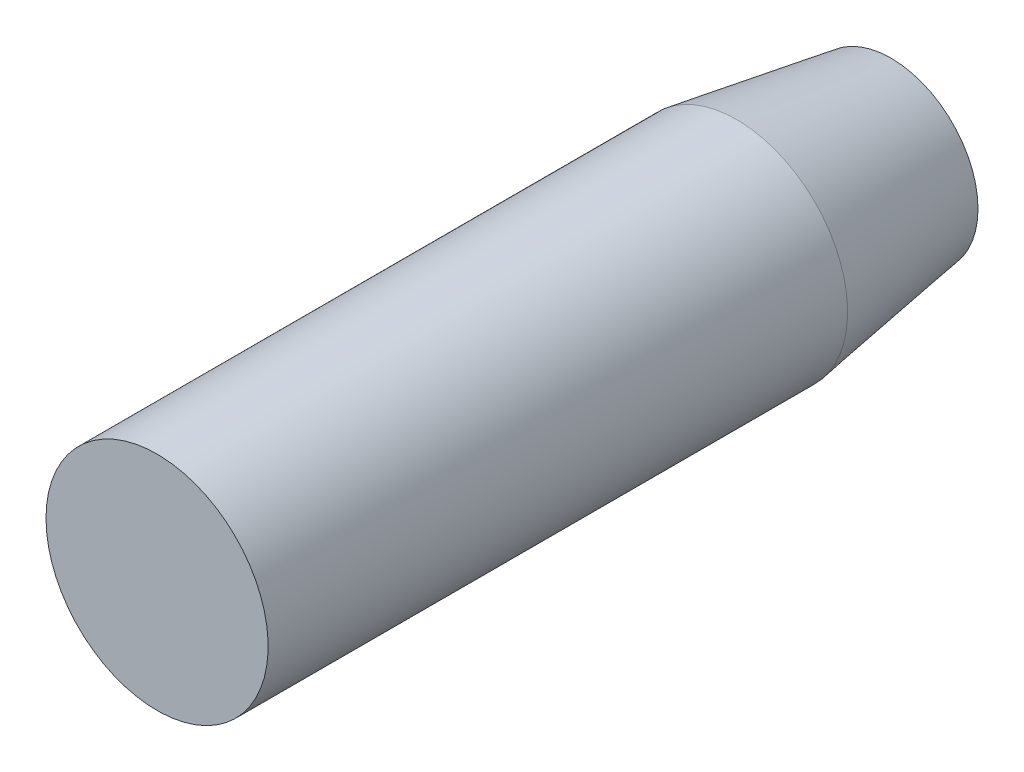
ISO-10303-21;
HEADER;
FILE_DESCRIPTION(('STEP AP214'),'2;1');
FILE_NAME('part.step','',(''),(''),'','','');
FILE_SCHEMA(('AUTOMOTIVE_DESIGN { 1 0 10303 214 1 1 1 1 }'));
ENDSEC;
DATA;
#1=APPLICATION_CONTEXT('core data for automotive mechanical design processes');
#2=APPLICATION_PROTOCOL_DEFINITION('international standard','automotive_design',2000,#1);
#3=PRODUCT_CONTEXT('',#1,'mechanical');
#4=PRODUCT('Part','Part','',(#3));
#5=PRODUCT_RELATED_PRODUCT_CATEGORY('part','',(#4));
#6=PRODUCT_DEFINITION_FORMATION('','',#4);
#7=PRODUCT_DEFINITION_CONTEXT('part definition',#1,'design');
#8=PRODUCT_DEFINITION('design','',#6,#7);
#9=PRODUCT_DEFINITION_SHAPE('','',#8);
#10=(LENGTH_UNIT() NAMED_UNIT(*) SI_UNIT(.MILLI.,.METRE.));
#11=(NAMED_UNIT(*) PLANE_ANGLE_UNIT() SI_UNIT($,.RADIAN.));
#12=(NAMED_UNIT(*) SI_UNIT($,.STERADIAN.) SOLID_ANGLE_UNIT());
#13=UNCERTAINTY_MEASURE_WITH_UNIT(LENGTH_MEASURE(1.E-05),#10,'distance_accuracy_value','');
#14=(GEOMETRIC_REPRESENTATION_CONTEXT(3) GLOBAL_UNCERTAINTY_ASSIGNED_CONTEXT((#13)) GLOBAL_UNIT_ASSIGNED_CONTEXT((#10,
#11,#12)) REPRESENTATION_CONTEXT('',''));
#15=CARTESIAN_POINT('',(0.,0.,0.));
#16=DIRECTION('',(0.,0.,1.));
#17=DIRECTION('',(1.,0.,0.));
#18=AXIS2_PLACEMENT_3D('',#15,#16,#17);
#19=CARTESIAN_POINT('',(0.,0.,-60.325));
#20=DIRECTION('',(0.,0.,1.));
#21=DIRECTION('',(-1.,0.,0.));
#22=AXIS2_PLACEMENT_3D('',#19,#20,#21);
#23=CYLINDRICAL_SURFACE('',#22,18.25625);
#24=CARTESIAN_POINT('',(0.,0.,-34.9250000000015));
#25=DIRECTION('',(0.,0.,1.));
#26=DIRECTION('',(1.,0.,0.));
#27=AXIS2_PLACEMENT_3D('',#24,#25,#26);
#28=CIRCLE('',#27,18.25625);
#29=CARTESIAN_POINT('',(-18.25625,0.,-34.9250000000015));
#30=VERTEX_POINT('',#29);
#31=EDGE_CURVE('E10',#30,#30,#28,.F.);
#32=CARTESIAN_POINT('',(0.,0.,60.325));
#33=DIRECTION('',(0.,0.,1.));
#34=DIRECTION('',(1.,0.,0.));
#35=AXIS2_PLACEMENT_3D('',#32,#33,#34);
#36=CIRCLE('',#35,18.25625);
#37=CARTESIAN_POINT('',(-18.25625,0.,60.325));
#38=VERTEX_POINT('',#37);
#39=EDGE_CURVE('E55',#38,#38,#36,.T.);
#40=CARTESIAN_POINT('',(-18.25625,0.,-34.9250000000015));
#41=CARTESIAN_POINT('',(-18.25625,0.,-33.9328125000015));
#42=CARTESIAN_POINT('',(-18.25625,0.,-32.9406250000014));
#43=CARTESIAN_POINT('',(-18.25625,0.,-30.9562500000014));
#44=CARTESIAN_POINT('',(-18.25625,0.,-29.9640625000014));
#45=CARTESIAN_POINT('',(-18.25625,0.,-27.9796875000014));
#46=CARTESIAN_POINT('',(-18.25625,0.,-26.9875000000014));
#47=CARTESIAN_POINT('',(-18.25625,0.,-25.0031250000013));
#48=CARTESIAN_POINT('',(-18.25625,0.,-24.0109375000013));
#49=CARTESIAN_POINT('',(-18.25625,0.,-22.0265625000013));
#50=CARTESIAN_POINT('',(-18.25625,0.,-21.0343750000013));
#51=CARTESIAN_POINT('',(-18.25625,0.,-19.0500000000012));
#52=CARTESIAN_POINT('',(-18.25625,0.,-18.0578125000012));
#53=CARTESIAN_POINT('',(-18.25625,0.,-16.0734375000012));
#54=CARTESIAN_POINT('',(-18.25625,0.,-15.0812500000012));
#55=CARTESIAN_POINT('',(-18.25625,0.,-13.0968750000011));
#56=CARTESIAN_POINT('',(-18.25625,0.,-12.1046875000011));
#57=CARTESIAN_POINT('',(-18.25625,0.,-10.1203125000011));
#58=CARTESIAN_POINT('',(-18.25625,0.,-9.12812500000108));
#59=CARTESIAN_POINT('',(-18.25625,0.,-7.14375000000105));
#60=CARTESIAN_POINT('',(-18.25625,0.,-6.15156250000103));
#61=CARTESIAN_POINT('',(-18.25625,0.,-4.167187500001));
#62=CARTESIAN_POINT('',(-18.25625,0.,-3.17500000000099));
#63=CARTESIAN_POINT('',(-18.25625,0.,-1.19062500000096));
#64=CARTESIAN_POINT('',(-18.25625,0.,-0.198437500000941));
#65=CARTESIAN_POINT('',(-18.25625,0.,1.78593749999909));
#66=CARTESIAN_POINT('',(-18.25625,0.,2.7781249999991));
#67=CARTESIAN_POINT('',(-18.25625,0.,4.76249999999913));
#68=CARTESIAN_POINT('',(-18.25625,0.,5.75468749999915));
#69=CARTESIAN_POINT('',(-18.25625,0.,7.73906249999918));
#70=CARTESIAN_POINT('',(-18.25625,0.,8.7312499999992));
#71=CARTESIAN_POINT('',(-18.25625,0.,10.7156249999992));
#72=CARTESIAN_POINT('',(-18.25625,0.,11.7078124999992));
#73=CARTESIAN_POINT('',(-18.25625,0.,13.6921874999993));
#74=CARTESIAN_POINT('',(-18.25625,0.,14.6843749999993));
#75=CARTESIAN_POINT('',(-18.25625,0.,16.6687499999993));
#76=CARTESIAN_POINT('',(-18.25625,0.,17.6609374999993));
#77=CARTESIAN_POINT('',(-18.25625,0.,19.6453124999994));
#78=CARTESIAN_POINT('',(-18.25625,0.,20.6374999999994));
#79=CARTESIAN_POINT('',(-18.25625,0.,22.6218749999994));
#80=CARTESIAN_POINT('',(-18.25625,0.,23.6140624999994));
#81=CARTESIAN_POINT('',(-18.25625,0.,25.5984374999995));
#82=CARTESIAN_POINT('',(-18.25625,0.,26.5906249999995));
#83=CARTESIAN_POINT('',(-18.25625,0.,28.5749999999995));
#84=CARTESIAN_POINT('',(-18.25625,0.,29.5671874999995));
#85=CARTESIAN_POINT('',(-18.25625,0.,31.5515624999995));
#86=CARTESIAN_POINT('',(-18.25625,0.,32.5437499999996));
#87=CARTESIAN_POINT('',(-18.25625,0.,34.5281249999996));
#88=CARTESIAN_POINT('',(-18.25625,0.,35.5203124999996));
#89=CARTESIAN_POINT('',(-18.25625,0.,37.5046874999996));
#90=CARTESIAN_POINT('',(-18.25625,0.,38.4968749999997));
#91=CARTESIAN_POINT('',(-18.25625,0.,40.4812499999997));
#92=CARTESIAN_POINT('',(-18.25625,0.,41.4734374999997));
#93=CARTESIAN_POINT('',(-18.25625,0.,43.4578124999997));
#94=CARTESIAN_POINT('',(-18.25625,0.,44.4499999999997));
#95=CARTESIAN_POINT('',(-18.25625,0.,46.4343749999998));
#96=CARTESIAN_POINT('',(-18.25625,0.,47.4265624999998));
#97=CARTESIAN_POINT('',(-18.25625,0.,49.4109374999998));
#98=CARTESIAN_POINT('',(-18.25625,0.,50.4031249999998));
#99=CARTESIAN_POINT('',(-18.25625,0.,52.3874999999999));
#100=CARTESIAN_POINT('',(-18.25625,0.,53.3796874999999));
#101=CARTESIAN_POINT('',(-18.25625,0.,55.3640624999999));
#102=CARTESIAN_POINT('',(-18.25625,0.,56.3562499999999));
#103=CARTESIAN_POINT('',(-18.25625,0.,58.340625));
#104=CARTESIAN_POINT('',(-18.25625,0.,59.3328125));
#105=CARTESIAN_POINT('',(-18.25625,0.,60.325));
#106=B_SPLINE_CURVE_WITH_KNOTS('',3,(#40,#41,#42,#43,#44,#45,#46,#47,#48,#49,#50,#51,#52,#53,
#54,#55,#56,#57,#58,#59,#60,#61,#62,#63,#64,#65,#66,#67,#68,#69,#70,#71,#72,#73,#74,#75,#76,#77,
#78,#79,#80,#81,#82,#83,#84,#85,#86,#87,#88,#89,#90,#91,#92,#93,#94,#95,#96,#97,#98,#99,#100,
#101,#102,#103,#104,#105),.UNSPECIFIED.,.F.,.F.,(4,2,2,2,2,2,2,2,2,2,2,2,2,2,2,2,2,2,2,2,2,2,2,
2,2,2,2,2,2,2,2,2,4),(0.,2.97656250000004,5.95312500000009,8.92968750000013,11.9062500000002,
14.8828125000002,17.8593750000003,20.8359375000003,23.8125000000004,26.7890625000004,
29.7656250000005,32.7421875000005,35.7187500000005,38.6953125000006,41.6718750000006,
44.6484375000007,47.6250000000007,50.6015625000008,53.5781250000008,56.5546875000009,
59.5312500000009,62.507812500001,65.484375000001,68.460937500001,71.4375000000011,
74.4140625000012,77.3906250000012,80.3671875000012,83.3437500000013,86.3203125000013,
89.2968750000014,92.2734375000014,95.2500000000015),.UNSPECIFIED.);
#107=EDGE_CURVE('BSEAM41',#30,#38,#106,.T.);
#108=ORIENTED_EDGE('',*,*,#31,.F.);
#109=ORIENTED_EDGE('',*,*,#39,.F.);
#110=ORIENTED_EDGE('',*,*,#107,.T.);
#111=ORIENTED_EDGE('',*,*,#107,.F.);
#112=EDGE_LOOP('',(#108,#110,#109,#111));
#113=FACE_BOUND('',#112,.T.);
#114=ADVANCED_FACE('F41',(#113),#23,.T.);
#115=CARTESIAN_POINT('',(0.,0.,-60.325));
#116=DIRECTION('',(0.,0.,-1.));
#117=DIRECTION('',(1.,0.,0.));
#118=AXIS2_PLACEMENT_3D('',#115,#116,#117);
#119=PLANE('',#118);
#120=CARTESIAN_POINT('',(0.,0.,-60.325));
#121=DIRECTION('',(0.,0.,1.));
#122=DIRECTION('',(1.,0.,0.));
#123=AXIS2_PLACEMENT_3D('',#120,#121,#122);
#124=CIRCLE('',#123,14.2875000000003);
#125=CARTESIAN_POINT('',(-14.2875000000003,0.,-60.325));
#126=VERTEX_POINT('',#125);
#127=EDGE_CURVE('E49',#126,#126,#124,.T.);
#128=ORIENTED_EDGE('',*,*,#127,.F.);
#129=EDGE_LOOP('',(#128));
#130=FACE_BOUND('',#129,.T.);
#131=ADVANCED_FACE('F65',(#130),#119,.T.);
#132=CARTESIAN_POINT('',(0.,0.,60.325));
#133=DIRECTION('',(0.,0.,-1.));
#134=DIRECTION('',(1.,0.,0.));
#135=AXIS2_PLACEMENT_3D('',#132,#133,#134);
#136=PLANE('',#135);
#137=ORIENTED_EDGE('',*,*,#39,.T.);
#138=EDGE_LOOP('',(#137));
#139=FACE_BOUND('',#138,.T.);
#140=ADVANCED_FACE('F62',(#139),#136,.F.);
#141=CARTESIAN_POINT('',(0.,0.,-60.325));
#142=DIRECTION('',(0.,0.,1.));
#143=DIRECTION('',(-1.,0.,0.));
#144=AXIS2_PLACEMENT_3D('',#141,#142,#143);
#145=CONICAL_SURFACE('',#144,14.2875000000003,0.154996741923938);
#146=CARTESIAN_POINT('',(-18.25625,0.,-34.9250000000015));
#147=CARTESIAN_POINT('',(-18.2149088541667,0.,-35.1895833333348));
#148=CARTESIAN_POINT('',(-18.1735677083333,0.,-35.4541666666681));
#149=CARTESIAN_POINT('',(-18.0908854166667,0.,-35.9833333333347));
#150=CARTESIAN_POINT('',(-18.0495442708333,0.,-36.2479166666681));
#151=CARTESIAN_POINT('',(-17.9668619791667,0.,-36.7770833333347));
#152=CARTESIAN_POINT('',(-17.9255208333334,0.,-37.041666666668));
#153=CARTESIAN_POINT('',(-17.8428385416667,0.,-37.5708333333346));
#154=CARTESIAN_POINT('',(-17.8014973958334,0.,-37.835416666668));
#155=CARTESIAN_POINT('',(-17.7188151041667,0.,-38.3645833333346));
#156=CARTESIAN_POINT('',(-17.6774739583334,0.,-38.6291666666679));
#157=CARTESIAN_POINT('',(-17.5947916666667,0.,-39.1583333333346));
#158=CARTESIAN_POINT('',(-17.5534505208334,0.,-39.4229166666679));
#159=CARTESIAN_POINT('',(-17.4707682291667,0.,-39.9520833333345));
#160=CARTESIAN_POINT('',(-17.4294270833334,0.,-40.2166666666678));
#161=CARTESIAN_POINT('',(-17.3467447916667,0.,-40.7458333333345));
#162=CARTESIAN_POINT('',(-17.3054036458334,0.,-41.0104166666678));
#163=CARTESIAN_POINT('',(-17.2227213541668,0.,-41.5395833333344));
#164=CARTESIAN_POINT('',(-17.1813802083334,0.,-41.8041666666677));
#165=CARTESIAN_POINT('',(-17.0986979166668,0.,-42.3333333333344));
#166=CARTESIAN_POINT('',(-17.0573567708334,0.,-42.5979166666677));
#167=CARTESIAN_POINT('',(-16.9746744791668,0.,-43.1270833333343));
#168=CARTESIAN_POINT('',(-16.9333333333334,0.,-43.3916666666676));
#169=CARTESIAN_POINT('',(-16.8506510416668,0.,-43.9208333333343));
#170=CARTESIAN_POINT('',(-16.8093098958335,0.,-44.1854166666676));
#171=CARTESIAN_POINT('',(-16.7266276041668,0.,-44.7145833333342));
#172=CARTESIAN_POINT('',(-16.6852864583335,0.,-44.9791666666676));
#173=CARTESIAN_POINT('',(-16.6026041666668,0.,-45.5083333333342));
#174=CARTESIAN_POINT('',(-16.5612630208335,0.,-45.7729166666675));
#175=CARTESIAN_POINT('',(-16.4785807291668,0.,-46.3020833333341));
#176=CARTESIAN_POINT('',(-16.4372395833335,0.,-46.5666666666675));
#177=CARTESIAN_POINT('',(-16.3545572916668,0.,-47.0958333333341));
#178=CARTESIAN_POINT('',(-16.3132161458335,0.,-47.3604166666674));
#179=CARTESIAN_POINT('',(-16.2305338541668,0.,-47.8895833333341));
#180=CARTESIAN_POINT('',(-16.1891927083335,0.,-48.1541666666674));
#181=CARTESIAN_POINT('',(-16.1065104166668,0.,-48.683333333334));
#182=CARTESIAN_POINT('',(-16.0651692708335,0.,-48.9479166666673));
#183=CARTESIAN_POINT('',(-15.9824869791668,0.,-49.477083333334));
#184=CARTESIAN_POINT('',(-15.9411458333335,0.,-49.7416666666673));
#185=CARTESIAN_POINT('',(-15.8584635416669,0.,-50.2708333333339));
#186=CARTESIAN_POINT('',(-15.8171223958335,0.,-50.5354166666672));
#187=CARTESIAN_POINT('',(-15.7344401041669,0.,-51.0645833333339));
#188=CARTESIAN_POINT('',(-15.6930989583335,0.,-51.3291666666672));
#189=CARTESIAN_POINT('',(-15.6104166666669,0.,-51.8583333333338));
#190=CARTESIAN_POINT('',(-15.5690755208336,0.,-52.1229166666671));
#191=CARTESIAN_POINT('',(-15.4863932291669,0.,-52.6520833333338));
#192=CARTESIAN_POINT('',(-15.4450520833336,0.,-52.9166666666671));
#193=CARTESIAN_POINT('',(-15.3623697916669,0.,-53.4458333333337));
#194=CARTESIAN_POINT('',(-15.3210286458336,0.,-53.7104166666671));
#195=CARTESIAN_POINT('',(-15.2383463541669,0.,-54.2395833333337));
#196=CARTESIAN_POINT('',(-15.1970052083336,0.,-54.504166666667));
#197=CARTESIAN_POINT('',(-15.1143229166669,0.,-55.0333333333336));
#198=CARTESIAN_POINT('',(-15.0729817708336,0.,-55.297916666667));
#199=CARTESIAN_POINT('',(-14.9902994791669,0.,-55.8270833333336));
#200=CARTESIAN_POINT('',(-14.9489583333336,0.,-56.0916666666669));
#201=CARTESIAN_POINT('',(-14.8662760416669,0.,-56.6208333333336));
#202=CARTESIAN_POINT('',(-14.8249348958336,0.,-56.8854166666669));
#203=CARTESIAN_POINT('',(-14.7422526041669,0.,-57.4145833333335));
#204=CARTESIAN_POINT('',(-14.7009114583336,0.,-57.6791666666668));
#205=CARTESIAN_POINT('',(-14.618229166667,0.,-58.2083333333335));
#206=CARTESIAN_POINT('',(-14.5768880208336,0.,-58.4729166666668));
#207=CARTESIAN_POINT('',(-14.494205729167,0.,-59.0020833333334));
#208=CARTESIAN_POINT('',(-14.4528645833336,0.,-59.2666666666667));
#209=CARTESIAN_POINT('',(-14.370182291667,0.,-59.7958333333334));
#210=CARTESIAN_POINT('',(-14.3288411458337,0.,-60.0604166666667));
#211=CARTESIAN_POINT('',(-14.2875000000003,0.,-60.325));
#212=B_SPLINE_CURVE_WITH_KNOTS('',3,(#146,#147,#148,#149,#150,#151,#152,#153,#154,#155,#156,
#157,#158,#159,#160,#161,#162,#163,#164,#165,#166,#167,#168,#169,#170,#171,#172,#173,#174,#175,
#176,#177,#178,#179,#180,#181,#182,#183,#184,#185,#186,#187,#188,#189,#190,#191,#192,#193,#194,
#195,#196,#197,#198,#199,#200,#201,#202,#203,#204,#205,#206,#207,#208,#209,#210,#211),
.UNSPECIFIED.,.F.,.F.,(4,2,2,2,2,2,2,2,2,2,2,2,2,2,2,2,2,2,2,2,2,2,2,2,2,2,2,2,2,2,2,2,4),(0.,
0.803380903151949,1.6067618063039,2.41014270945585,3.2135236126078,4.01690451575974,
4.82028541891169,5.62366632206364,6.42704722521559,7.23042812836754,8.03380903151949,
8.83718993467144,9.64057083782339,10.4439517409753,11.2473326441273,12.0507135472792,
12.8540944504312,13.6574753535831,14.4608562567351,15.264237159887,16.067618063039,
16.8709989661909,17.6743798693429,18.4777607724948,19.2811416756468,20.0845225787987,
20.8879034819507,21.6912843851026,22.4946652882546,23.2980461914065,24.1014270945585,
24.9048079977104,25.7081889008623),.UNSPECIFIED.);
#213=EDGE_CURVE('BSEAM43',#30,#126,#212,.T.);
#214=ORIENTED_EDGE('',*,*,#31,.T.);
#215=ORIENTED_EDGE('',*,*,#127,.T.);
#216=ORIENTED_EDGE('',*,*,#213,.T.);
#217=ORIENTED_EDGE('',*,*,#213,.F.);
#218=EDGE_LOOP('',(#214,#216,#215,#217));
#219=FACE_BOUND('',#218,.T.);
#220=ADVANCED_FACE('F43',(#219),#145,.T.);
#221=CLOSED_SHELL('',(#114,#131,#140,#220));
#222=MANIFOLD_SOLID_BREP('B2',#221);
#223=ADVANCED_BREP_SHAPE_REPRESENTATION('',(#18,#222),#14);
#224=SHAPE_DEFINITION_REPRESENTATION(#9,#223);
ENDSEC;
END-ISO-10303-21;
